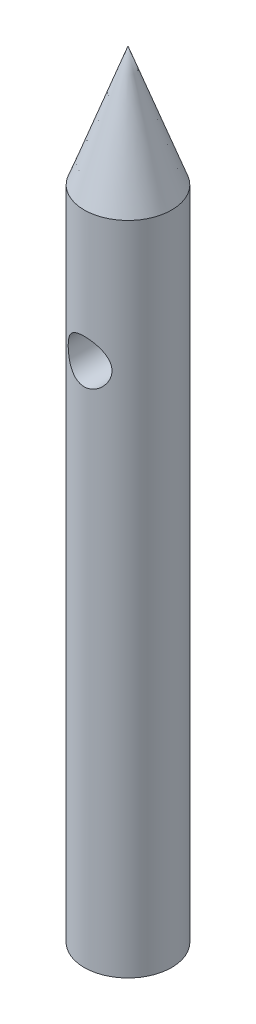
ISO-10303-21;
HEADER;
FILE_DESCRIPTION(('STEP AP214'),'2;1');
FILE_NAME('part.step','',(''),(''),'','','');
FILE_SCHEMA(('AUTOMOTIVE_DESIGN { 1 0 10303 214 1 1 1 1 }'));
ENDSEC;
DATA;
#1=APPLICATION_CONTEXT('core data for automotive mechanical design processes');
#2=APPLICATION_PROTOCOL_DEFINITION('international standard','automotive_design',2000,#1);
#3=PRODUCT_CONTEXT('',#1,'mechanical');
#4=PRODUCT('Part','Part','',(#3));
#5=PRODUCT_RELATED_PRODUCT_CATEGORY('part','',(#4));
#6=PRODUCT_DEFINITION_FORMATION('','',#4);
#7=PRODUCT_DEFINITION_CONTEXT('part definition',#1,'design');
#8=PRODUCT_DEFINITION('design','',#6,#7);
#9=PRODUCT_DEFINITION_SHAPE('','',#8);
#10=(LENGTH_UNIT() NAMED_UNIT(*) SI_UNIT(.MILLI.,.METRE.));
#11=(NAMED_UNIT(*) PLANE_ANGLE_UNIT() SI_UNIT($,.RADIAN.));
#12=(NAMED_UNIT(*) SI_UNIT($,.STERADIAN.) SOLID_ANGLE_UNIT());
#13=UNCERTAINTY_MEASURE_WITH_UNIT(LENGTH_MEASURE(1.E-05),#10,'distance_accuracy_value','');
#14=(GEOMETRIC_REPRESENTATION_CONTEXT(3) GLOBAL_UNCERTAINTY_ASSIGNED_CONTEXT((#13)) GLOBAL_UNIT_ASSIGNED_CONTEXT((#10,
#11,#12)) REPRESENTATION_CONTEXT('',''));
#15=CARTESIAN_POINT('',(0.,0.,0.));
#16=DIRECTION('',(0.,0.,1.));
#17=DIRECTION('',(1.,0.,0.));
#18=AXIS2_PLACEMENT_3D('',#15,#16,#17);
#19=CARTESIAN_POINT('',(0.,30.,0.));
#20=DIRECTION('',(0.,-1.,0.));
#21=DIRECTION('',(0.,0.,1.));
#22=AXIS2_PLACEMENT_3D('',#19,#20,#21);
#23=CONICAL_SURFACE('',#22,2.,0.349065850398867);
#24=CARTESIAN_POINT('',(0.,35.4949548389092,0.));
#25=VERTEX_POINT('',#24);
#26=VERTEX_LOOP('',#25);
#27=FACE_BOUND('',#26,.T.);
#28=CARTESIAN_POINT('',(0.,30.,0.));
#29=DIRECTION('',(0.,1.,0.));
#30=DIRECTION('',(0.,0.,1.));
#31=AXIS2_PLACEMENT_3D('',#28,#29,#30);
#32=CIRCLE('',#31,2.);
#33=CARTESIAN_POINT('',(0.,30.,2.));
#34=VERTEX_POINT('',#33);
#35=EDGE_CURVE('E12',#34,#34,#32,.T.);
#36=ORIENTED_EDGE('',*,*,#35,.T.);
#37=EDGE_LOOP('',(#36));
#38=FACE_BOUND('',#37,.T.);
#39=ADVANCED_FACE('F47',(#27,#38),#23,.T.);
#40=CARTESIAN_POINT('',(0.,30.,0.));
#41=DIRECTION('',(0.,1.,0.));
#42=DIRECTION('',(0.,0.,1.));
#43=AXIS2_PLACEMENT_3D('',#40,#41,#42);
#44=PLANE('',#43);
#45=ORIENTED_EDGE('',*,*,#35,.F.);
#46=EDGE_LOOP('',(#45));
#47=FACE_BOUND('',#46,.T.);
#48=ADVANCED_FACE('F56',(#47),#44,.F.);
#49=CLOSED_SHELL('',(#39,#48));
#50=MANIFOLD_SOLID_BREP('B2',#49);
#51=CARTESIAN_POINT('',(0.,30.,0.));
#52=DIRECTION('',(0.,-1.,0.));
#53=DIRECTION('',(0.,0.,-1.));
#54=AXIS2_PLACEMENT_3D('',#51,#52,#53);
#55=CYLINDRICAL_SURFACE('',#54,2.);
#56=CARTESIAN_POINT('',(0.,25.,-2.));
#57=CARTESIAN_POINT('',(-0.0525719629529864,24.9999966976805,-1.99999713404151));
#58=CARTESIAN_POINT('',(-0.105206599698033,24.9958299268783,-1.99790491019518));
#59=CARTESIAN_POINT('',(-0.208920235268425,24.9793471196591,-1.98974156037396));
#60=CARTESIAN_POINT('',(-0.259996086713504,24.9670156070023,-1.98366287828984));
#61=CARTESIAN_POINT('',(-0.358933544880574,24.9348061913832,-1.96816279403312));
#62=CARTESIAN_POINT('',(-0.406806802939179,24.914957615752,-1.9587543917752));
#63=CARTESIAN_POINT('',(-0.498472616806564,24.8684293786351,-1.93745776515779));
#64=CARTESIAN_POINT('',(-0.542265493990049,24.8417502557511,-1.9255697363353));
#65=CARTESIAN_POINT('',(-0.627507817761918,24.7804827505147,-1.89956258258057));
#66=CARTESIAN_POINT('',(-0.668655211122111,24.7455135207604,-1.88535199127536));
#67=CARTESIAN_POINT('',(-0.744779444866976,24.669478520753,-1.85659970246744));
#68=CARTESIAN_POINT('',(-0.779751583106766,24.6284081482276,-1.84205776209035));
#69=CARTESIAN_POINT('',(-0.845252000450278,24.5375166504766,-1.81298951197347));
#70=CARTESIAN_POINT('',(-0.875225335551636,24.4872639016541,-1.79855186970132));
#71=CARTESIAN_POINT('',(-0.926168226890694,24.3816326640138,-1.77285978772321));
#72=CARTESIAN_POINT('',(-0.947144214966333,24.3262578712772,-1.7616030760699));
#73=CARTESIAN_POINT('',(-0.978132442188588,24.2153348945781,-1.74457867037809));
#74=CARTESIAN_POINT('',(-0.98872585708044,24.1599955479326,-1.73852271583714));
#75=CARTESIAN_POINT('',(-1.00042699330884,24.0480211622205,-1.73181889948528));
#76=CARTESIAN_POINT('',(-1.00154408837307,23.9913874591288,-1.73116569343288));
#77=CARTESIAN_POINT('',(-0.994687287172294,23.8857139756846,-1.73510930257248));
#78=CARTESIAN_POINT('',(-0.987784559536821,23.836575968777,-1.73908763662014));
#79=CARTESIAN_POINT('',(-0.966939849056933,23.740278090627,-1.7507622873385));
#80=CARTESIAN_POINT('',(-0.952995623897652,23.6931188546947,-1.75845978831776));
#81=CARTESIAN_POINT('',(-0.918209780386004,23.6007708674343,-1.77687476412741));
#82=CARTESIAN_POINT('',(-0.897215067115995,23.5556536012142,-1.78765840663998));
#83=CARTESIAN_POINT('',(-0.849041687668002,23.46936570741,-1.81103404281404));
#84=CARTESIAN_POINT('',(-0.821860243812466,23.4281968643999,-1.82362684780191));
#85=CARTESIAN_POINT('',(-0.758066054912787,23.3454787472568,-1.85113157903286));
#86=CARTESIAN_POINT('',(-0.720694458369281,23.3045431264238,-1.86613510236746));
#87=CARTESIAN_POINT('',(-0.639555578741374,23.2292645814091,-1.89547623300407));
#88=CARTESIAN_POINT('',(-0.595785256574286,23.1949248079661,-1.90981351958801));
#89=CARTESIAN_POINT('',(-0.500516505831849,23.1323143389703,-1.93701987282964));
#90=CARTESIAN_POINT('',(-0.448753591599409,23.1043995275543,-1.94978984162007));
#91=CARTESIAN_POINT('',(-0.340466215488798,23.057902970957,-1.97157881121242));
#92=CARTESIAN_POINT('',(-0.283945576265278,23.0393138149848,-1.98060078943553));
#93=CARTESIAN_POINT('',(-0.172766491660703,23.0135245962833,-1.99324333741436));
#94=CARTESIAN_POINT('',(-0.118341530548326,23.0055087642532,-1.99724938301312));
#95=CARTESIAN_POINT('',(-0.00877959994935544,22.9985352688655,-2.00073013459102));
#96=CARTESIAN_POINT('',(0.0463570198698997,22.9995733143605,-2.00020698721312));
#97=CARTESIAN_POINT('',(0.151232971985992,23.0102066884188,-1.99491192253441));
#98=CARTESIAN_POINT('',(0.201059408049953,23.01913253273,-1.9904724568819));
#99=CARTESIAN_POINT('',(0.298406892301915,23.0442380718951,-1.97822171314819));
#100=CARTESIAN_POINT('',(0.345927685690996,23.0604185664534,-1.97041006334333));
#101=CARTESIAN_POINT('',(0.438888608449664,23.0999984664332,-1.95184251413669));
#102=CARTESIAN_POINT('',(0.484230397006153,23.1235910501168,-1.94100881769939));
#103=CARTESIAN_POINT('',(0.57046136169892,23.177107535646,-1.91743974317109));
#104=CARTESIAN_POINT('',(0.611348629775281,23.2070341345934,-1.90470355565785));
#105=CARTESIAN_POINT('',(0.691767689290652,23.2757604253329,-1.87708221337464));
#106=CARTESIAN_POINT('',(0.730772077824637,23.3151428684536,-1.86210884848441));
#107=CARTESIAN_POINT('',(0.801856321113238,23.3999251512693,-1.83262391603874));
#108=CARTESIAN_POINT('',(0.833931385690841,23.4453291188164,-1.81811267381526));
#109=CARTESIAN_POINT('',(0.891707914497695,23.5436436542003,-1.79051192226068));
#110=CARTESIAN_POINT('',(0.917025495878636,23.5968112662086,-1.77752529663472));
#111=CARTESIAN_POINT('',(0.958082826013802,23.7075100676925,-1.75574072368126));
#112=CARTESIAN_POINT('',(0.973834915887569,23.7650355265012,-1.74693738240618));
#113=CARTESIAN_POINT('',(0.993861687449678,23.8769102228615,-1.73561501008667));
#114=CARTESIAN_POINT('',(0.999092996400864,23.931034253429,-1.73257383460491));
#115=CARTESIAN_POINT('',(1.00068915438079,24.0394470671707,-1.73165354646175));
#116=CARTESIAN_POINT('',(0.997057846624398,24.0937357687394,-1.73377219627553));
#117=CARTESIAN_POINT('',(0.981926125592262,24.195483501532,-1.74237862050025));
#118=CARTESIAN_POINT('',(0.971208314342799,24.2431004701444,-1.74843094482394));
#119=CARTESIAN_POINT('',(0.943175358224644,24.3358081194247,-1.76371016187918));
#120=CARTESIAN_POINT('',(0.925858091159809,24.380897982092,-1.77293807569676));
#121=CARTESIAN_POINT('',(0.883815745300682,24.4706248509866,-1.79428530364528));
#122=CARTESIAN_POINT('',(0.858671137816458,24.5150279018297,-1.80655722396191));
#123=CARTESIAN_POINT('',(0.802150971636635,24.5992745361806,-1.8323533163459));
#124=CARTESIAN_POINT('',(0.770772171238649,24.6391157305185,-1.84587813794522));
#125=CARTESIAN_POINT('',(0.698203326664641,24.7181419823576,-1.87462323159313));
#126=CARTESIAN_POINT('',(0.65628442301017,24.7566591023619,-1.88984983311469));
#127=CARTESIAN_POINT('',(0.566154806220278,24.8262629834236,-1.91877752255088));
#128=CARTESIAN_POINT('',(0.517940723256784,24.8573457394263,-1.9324777860804));
#129=CARTESIAN_POINT('',(0.415931596819946,24.9112363627622,-1.95698009585103));
#130=CARTESIAN_POINT('',(0.362099503934614,24.9339841694114,-1.96776096562909));
#131=CARTESIAN_POINT('',(0.250742101294192,24.969808167919,-1.98501341363465));
#132=CARTESIAN_POINT('',(0.193227799623167,24.9829118468296,-1.99149723372932));
#133=CARTESIAN_POINT('',(0.112601946483385,24.9938974110758,-1.99695461909663));
#134=CARTESIAN_POINT('',(0.0901618794394999,24.9961826408636,-1.99809365339202));
#135=CARTESIAN_POINT('',(0.0451517318071584,24.9992346655168,-1.99961696977865));
#136=CARTESIAN_POINT('',(0.0225816476473818,25.0000014184712,-2.00000123103763));
#137=CARTESIAN_POINT('',(0.,25.,-2.));
#138=B_SPLINE_CURVE_WITH_KNOTS('',3,(#56,#57,#58,#59,#60,#61,#62,#63,#64,#65,#66,#67,#68,#69,
#70,#71,#72,#73,#74,#75,#76,#77,#78,#79,#80,#81,#82,#83,#84,#85,#86,#87,#88,#89,#90,#91,#92,#93,
#94,#95,#96,#97,#98,#99,#100,#101,#102,#103,#104,#105,#106,#107,#108,#109,#110,#111,#112,#113,
#114,#115,#116,#117,#118,#119,#120,#121,#122,#123,#124,#125,#126,#127,#128,#129,#130,#131,#132,
#133,#134,#135,#136,#137),.UNSPECIFIED.,.T.,.F.,(4,2,2,2,2,2,2,2,2,2,2,2,2,2,2,2,2,2,2,2,2,2,2,
2,2,2,2,2,2,2,2,2,2,2,2,2,2,2,2,2,4),(0.,0.157624257420293,0.315548149709198,0.472862155492298,
0.630163760581567,0.796981758718089,0.963926237654036,1.14381726430753,1.32357947898281,
1.49258012140229,1.6614135732902,1.8100571240932,1.95874803925678,2.11090240168487,
2.26312521260222,2.43464941333878,2.60625534598686,2.7858302221444,2.96526216912279,
3.12983290471345,3.29432564511476,3.44606906506121,3.59782921630931,3.75392856027898,
3.91009450748339,4.08159610644418,4.25321588615432,4.43314682159673,4.61284511940777,
4.77529307498373,4.93767059860005,5.08457930244183,5.23153528783678,5.38836456775614,
5.54527561138957,5.72125242752498,5.89732383376572,6.07464013662925,6.2514490862493,
6.31915280137697,6.38685838514846),.UNSPECIFIED.);
#139=CARTESIAN_POINT('',(0.,25.,-2.));
#140=VERTEX_POINT('',#139);
#141=EDGE_CURVE('E46',#140,#140,#138,.T.);
#142=ORIENTED_EDGE('',*,*,#141,.T.);
#143=EDGE_LOOP('',(#142));
#144=FACE_BOUND('',#143,.T.);
#145=CARTESIAN_POINT('',(0.999999999999999,24.,1.73205080756888));
#146=CARTESIAN_POINT('',(0.999996363074531,23.9478921918048,1.73205534728459));
#147=CARTESIAN_POINT('',(0.995899970733216,23.895718588475,1.73443801187757));
#148=CARTESIAN_POINT('',(0.979723209898053,23.7929727353228,1.74362366452052));
#149=CARTESIAN_POINT('',(0.967626064554179,23.7424040849566,1.75043594055559));
#150=CARTESIAN_POINT('',(0.936099948699811,23.6445483356561,1.76749346605398));
#151=CARTESIAN_POINT('',(0.91670995249373,23.5972453475264,1.77772043473252));
#152=CARTESIAN_POINT('',(0.871267525376371,23.5065757980033,1.80042664816858));
#153=CARTESIAN_POINT('',(0.845214734035773,23.4632094497375,1.81290601476065));
#154=CARTESIAN_POINT('',(0.784666540530878,23.3776942714425,1.83996869057441));
#155=CARTESIAN_POINT('',(0.74965203614377,23.3359408643265,1.85464063637954));
#156=CARTESIAN_POINT('',(0.673253807614468,23.2585916115933,1.88371982785706));
#157=CARTESIAN_POINT('',(0.631866925782292,23.2229988374165,1.8981269383125));
#158=CARTESIAN_POINT('',(0.540489563414545,23.1566328488523,1.92621476952949));
#159=CARTESIAN_POINT('',(0.490107189012574,23.1263462321405,1.93978106418172));
#160=CARTESIAN_POINT('',(0.384157026599504,23.0748591467542,1.96350756099529));
#161=CARTESIAN_POINT('',(0.328592538138155,23.0536529438628,1.97366991183742));
#162=CARTESIAN_POINT('',(0.218044943925977,23.0224953386989,1.98880461244237));
#163=CARTESIAN_POINT('',(0.163301790488818,23.0118504736445,1.99409480220892));
#164=CARTESIAN_POINT('',(0.0525706286978488,22.999833881325,2.00007583846067));
#165=CARTESIAN_POINT('',(-0.00341660584373776,22.9984565432043,2.0007694678459));
#166=CARTESIAN_POINT('',(-0.109832524423749,23.0047466739704,1.9976298191645));
#167=CARTESIAN_POINT('',(-0.16032119917679,23.0116380155212,1.9941849589216));
#168=CARTESIAN_POINT('',(-0.259313771918321,23.0328808439047,1.98374245259747));
#169=CARTESIAN_POINT('',(-0.307817521093925,23.0472328889762,1.97674454066394));
#170=CARTESIAN_POINT('',(-0.402309391569552,23.0830825660898,1.95971583287654));
#171=CARTESIAN_POINT('',(-0.448253423515177,23.1046763131721,1.94964441529199));
#172=CARTESIAN_POINT('',(-0.535976801513327,23.1542634162015,1.92737645986687));
#173=CARTESIAN_POINT('',(-0.577754648838645,23.1822590633024,1.91517916157484));
#174=CARTESIAN_POINT('',(-0.660173660898195,23.246895351533,1.88844394399229));
#175=CARTESIAN_POINT('',(-0.70033407502936,23.284103028326,1.87379375998175));
#176=CARTESIAN_POINT('',(-0.77410437029778,23.3645897249302,1.84454340586812));
#177=CARTESIAN_POINT('',(-0.80770921157423,23.4078733722741,1.82994328265629));
#178=CARTESIAN_POINT('',(-0.869505334642211,23.5026481924241,1.80144156092485));
#179=CARTESIAN_POINT('',(-0.897217314978051,23.5544860230542,1.78764319990708));
#180=CARTESIAN_POINT('',(-0.94331911300123,23.662937671359,1.76375450278576));
#181=CARTESIAN_POINT('',(-0.961718658210889,23.7195464330176,1.75366030046067));
#182=CARTESIAN_POINT('',(-0.98718021102504,23.8312145112828,1.73944635817034));
#183=CARTESIAN_POINT('',(-0.995025122119975,23.8860411190436,1.73491655848496));
#184=CARTESIAN_POINT('',(-1.00151694661143,23.9964013415165,1.7311791936161));
#185=CARTESIAN_POINT('',(-1.00017035731502,24.0519344291198,1.73196786889312));
#186=CARTESIAN_POINT('',(-0.989036043343965,24.1556539185787,1.73834336540585));
#187=CARTESIAN_POINT('',(-0.980187816712466,24.2039794511079,1.74339587506654));
#188=CARTESIAN_POINT('',(-0.955696284632441,24.298367786271,1.75694021551341));
#189=CARTESIAN_POINT('',(-0.940050778623614,24.3444298507466,1.76543316005034));
#190=CARTESIAN_POINT('',(-0.901647588604886,24.4354113309027,1.78536222079657));
#191=CARTESIAN_POINT('',(-0.878594063692723,24.4801790168536,1.79691643243063));
#192=CARTESIAN_POINT('',(-0.826287064015804,24.565469271539,1.8215611949725));
#193=CARTESIAN_POINT('',(-0.797030404332216,24.6059896435133,1.83465253355148));
#194=CARTESIAN_POINT('',(-0.728837167198853,24.6869787675235,1.86287998456336));
#195=CARTESIAN_POINT('',(-0.689145272314965,24.7267971507177,1.87806583154289));
#196=CARTESIAN_POINT('',(-0.603404495398286,24.7994122379936,1.90734234977893));
#197=CARTESIAN_POINT('',(-0.557353474655346,24.8322065702305,1.92143265007709));
#198=CARTESIAN_POINT('',(-0.458535362558756,24.8905737259501,1.94741361690957));
#199=CARTESIAN_POINT('',(-0.405623097574112,24.9159331182109,1.95923641672029));
#200=CARTESIAN_POINT('',(-0.295522364641081,24.9571379038574,1.97883354959301));
#201=CARTESIAN_POINT('',(-0.238337701392175,24.9729916513663,1.98661143676373));
#202=CARTESIAN_POINT('',(-0.126979682330417,24.9933685641747,1.99667508181883));
#203=CARTESIAN_POINT('',(-0.0730114438504565,24.9987978758761,1.99939927908191));
#204=CARTESIAN_POINT('',(0.0351259859512041,25.0008432654544,2.00042130375131));
#205=CARTESIAN_POINT('',(0.0892951002950871,24.9974624285236,1.9987206806689));
#206=CARTESIAN_POINT('',(0.192537992317147,24.9825835932044,1.99133968837923));
#207=CARTESIAN_POINT('',(0.241712317811264,24.9716351507423,1.9859289466799));
#208=CARTESIAN_POINT('',(0.337445952183617,24.942673000697,1.97192093663423));
#209=CARTESIAN_POINT('',(0.384004884955508,24.9246582799065,1.96332321132796));
#210=CARTESIAN_POINT('',(0.475423406244884,24.881272947834,1.9432593074812));
#211=CARTESIAN_POINT('',(0.520125142700045,24.8556206767922,1.93168617198799));
#212=CARTESIAN_POINT('',(0.604774641814024,24.798042069141,1.90688133141826));
#213=CARTESIAN_POINT('',(0.644720207414907,24.7661128508843,1.89364886558361));
#214=CARTESIAN_POINT('',(0.722914004156892,24.6932028609773,1.86528610226628));
#215=CARTESIAN_POINT('',(0.760597684539272,24.6516375125228,1.85009799011698));
#216=CARTESIAN_POINT('',(0.828663287394675,24.5625492788702,1.82063076162852));
#217=CARTESIAN_POINT('',(0.859038750010058,24.5150211791323,1.80635245761865));
#218=CARTESIAN_POINT('',(0.912431079785654,24.413363353419,1.77999605304916));
#219=CARTESIAN_POINT('',(0.935185065960939,24.3590724688713,1.7680017425627));
#220=CARTESIAN_POINT('',(0.970878709506411,24.2466675956602,1.74866156328352));
#221=CARTESIAN_POINT('',(0.983851191175345,24.1885671110873,1.74130016147702));
#222=CARTESIAN_POINT('',(0.994367007864413,24.108194644348,1.73529272601791));
#223=CARTESIAN_POINT('',(0.99647610496385,24.0866321056021,1.73408129005152));
#224=CARTESIAN_POINT('',(0.999293405089962,24.0433835193178,1.7324593588775));
#225=CARTESIAN_POINT('',(1.00000151439987,24.0216974636141,1.73204891725109));
#226=CARTESIAN_POINT('',(0.999999999999999,24.,1.73205080756888));
#227=B_SPLINE_CURVE_WITH_KNOTS('',3,(#145,#146,#147,#148,#149,#150,#151,#152,#153,#154,#155,
#156,#157,#158,#159,#160,#161,#162,#163,#164,#165,#166,#167,#168,#169,#170,#171,#172,#173,#174,
#175,#176,#177,#178,#179,#180,#181,#182,#183,#184,#185,#186,#187,#188,#189,#190,#191,#192,#193,
#194,#195,#196,#197,#198,#199,#200,#201,#202,#203,#204,#205,#206,#207,#208,#209,#210,#211,#212,
#213,#214,#215,#216,#217,#218,#219,#220,#221,#222,#223,#224,#225,#226),.UNSPECIFIED.,.T.,.F.,(4,
2,2,2,2,2,2,2,2,2,2,2,2,2,2,2,2,2,2,2,2,2,2,2,2,2,2,2,2,2,2,2,2,2,2,2,2,2,2,2,4),(0.,
0.156232122594713,0.312792892824805,0.468528595918883,0.624272725445148,0.792862312498233,
0.961535710843709,1.14157892238763,1.32150826963891,1.48863484967935,1.6556602368604,
1.80816097484538,1.96067312517455,2.11529534731146,2.26997299350271,2.4392719145689,
2.60870048245918,2.78888841729448,2.96888774211704,3.13462290854211,3.30024093188373,
3.44774183424025,3.59529052436063,3.74967296406087,3.90413486220047,4.07806743580613,
4.25205864978202,4.43064181412965,4.60906779808771,4.77112270389486,4.93312086793971,
5.08444424871492,5.23578933512012,5.39360750719471,5.55149830100718,5.72510241850067,
5.89885942845154,6.07810749038604,6.25675133002759,6.32180135185309,6.3868557249454),.UNSPECIFIED.);
#228=CARTESIAN_POINT('',(0.999999999999999,24.,1.73205080756888));
#229=VERTEX_POINT('',#228);
#230=EDGE_CURVE('E86',#229,#229,#227,.T.);
#231=ORIENTED_EDGE('',*,*,#230,.T.);
#232=EDGE_LOOP('',(#231));
#233=FACE_BOUND('',#232,.T.);
#234=CARTESIAN_POINT('',(0.,30.,0.));
#235=DIRECTION('',(0.,1.,0.));
#236=DIRECTION('',(0.,0.,1.));
#237=AXIS2_PLACEMENT_3D('',#234,#235,#236);
#238=CIRCLE('',#237,2.);
#239=CARTESIAN_POINT('',(0.,30.,2.));
#240=VERTEX_POINT('',#239);
#241=EDGE_CURVE('E90',#240,#240,#238,.T.);
#242=ORIENTED_EDGE('',*,*,#241,.F.);
#243=EDGE_LOOP('',(#242));
#244=FACE_BOUND('',#243,.T.);
#245=CARTESIAN_POINT('',(0.,0.,0.));
#246=DIRECTION('',(0.,1.,0.));
#247=DIRECTION('',(0.,0.,1.));
#248=AXIS2_PLACEMENT_3D('',#245,#246,#247);
#249=CIRCLE('',#248,2.);
#250=CARTESIAN_POINT('',(0.,0.,2.));
#251=VERTEX_POINT('',#250);
#252=EDGE_CURVE('E94',#251,#251,#249,.T.);
#253=ORIENTED_EDGE('',*,*,#252,.T.);
#254=EDGE_LOOP('',(#253));
#255=FACE_BOUND('',#254,.T.);
#256=ADVANCED_FACE('F75',(#144,#233,#244,#255),#55,.T.);
#257=CARTESIAN_POINT('',(0.,30.,0.));
#258=DIRECTION('',(0.,1.,0.));
#259=DIRECTION('',(0.,0.,1.));
#260=AXIS2_PLACEMENT_3D('',#257,#258,#259);
#261=PLANE('',#260);
#262=ORIENTED_EDGE('',*,*,#241,.T.);
#263=EDGE_LOOP('',(#262));
#264=FACE_BOUND('',#263,.T.);
#265=ADVANCED_FACE('F106',(#264),#261,.T.);
#266=CARTESIAN_POINT('',(0.,0.,0.));
#267=DIRECTION('',(0.,1.,0.));
#268=DIRECTION('',(0.,0.,1.));
#269=AXIS2_PLACEMENT_3D('',#266,#267,#268);
#270=PLANE('',#269);
#271=ORIENTED_EDGE('',*,*,#252,.F.);
#272=EDGE_LOOP('',(#271));
#273=FACE_BOUND('',#272,.T.);
#274=ADVANCED_FACE('F104',(#273),#270,.F.);
#275=CARTESIAN_POINT('',(0.,24.,2.));
#276=DIRECTION('',(0.,0.,1.));
#277=DIRECTION('',(1.,0.,0.));
#278=AXIS2_PLACEMENT_3D('',#275,#276,#277);
#279=CYLINDRICAL_SURFACE('',#278,0.999999999999999);
#280=ORIENTED_EDGE('',*,*,#230,.F.);
#281=EDGE_LOOP('',(#280));
#282=FACE_BOUND('',#281,.T.);
#283=ORIENTED_EDGE('',*,*,#141,.F.);
#284=EDGE_LOOP('',(#283));
#285=FACE_BOUND('',#284,.T.);
#286=ADVANCED_FACE('F100',(#282,#285),#279,.F.);
#287=CLOSED_SHELL('',(#256,#265,#274,#286));
#288=MANIFOLD_SOLID_BREP('B6',#287);
#289=ADVANCED_BREP_SHAPE_REPRESENTATION('',(#18,#50,#288),#14);
#290=SHAPE_DEFINITION_REPRESENTATION(#9,#289);
ENDSEC;
END-ISO-10303-21;
